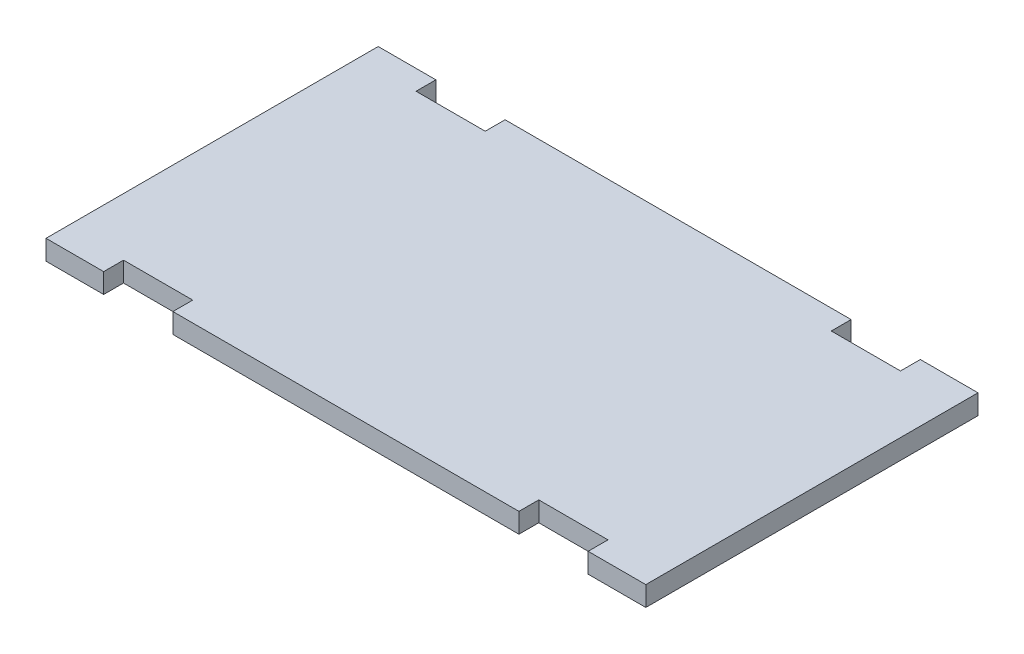
ISO-10303-21;
HEADER;
FILE_DESCRIPTION(('STEP AP214'),'2;1');
FILE_NAME('part.step','',(''),(''),'','','');
FILE_SCHEMA(('AUTOMOTIVE_DESIGN { 1 0 10303 214 1 1 1 1 }'));
ENDSEC;
DATA;
#1=APPLICATION_CONTEXT('core data for automotive mechanical design processes');
#2=APPLICATION_PROTOCOL_DEFINITION('international standard','automotive_design',2000,#1);
#3=PRODUCT_CONTEXT('',#1,'mechanical');
#4=PRODUCT('Part','Part','',(#3));
#5=PRODUCT_RELATED_PRODUCT_CATEGORY('part','',(#4));
#6=PRODUCT_DEFINITION_FORMATION('','',#4);
#7=PRODUCT_DEFINITION_CONTEXT('part definition',#1,'design');
#8=PRODUCT_DEFINITION('design','',#6,#7);
#9=PRODUCT_DEFINITION_SHAPE('','',#8);
#10=(LENGTH_UNIT() NAMED_UNIT(*) SI_UNIT(.MILLI.,.METRE.));
#11=(NAMED_UNIT(*) PLANE_ANGLE_UNIT() SI_UNIT($,.RADIAN.));
#12=(NAMED_UNIT(*) SI_UNIT($,.STERADIAN.) SOLID_ANGLE_UNIT());
#13=UNCERTAINTY_MEASURE_WITH_UNIT(LENGTH_MEASURE(1.E-05),#10,'distance_accuracy_value','');
#14=(GEOMETRIC_REPRESENTATION_CONTEXT(3) GLOBAL_UNCERTAINTY_ASSIGNED_CONTEXT((#13)) GLOBAL_UNIT_ASSIGNED_CONTEXT((#10,
#11,#12)) REPRESENTATION_CONTEXT('',''));
#15=CARTESIAN_POINT('',(0.,0.,0.));
#16=DIRECTION('',(0.,0.,1.));
#17=DIRECTION('',(1.,0.,0.));
#18=AXIS2_PLACEMENT_3D('',#15,#16,#17);
#19=CARTESIAN_POINT('',(-82.55,5.461,-45.461));
#20=DIRECTION('',(0.,0.,1.));
#21=DIRECTION('',(1.,0.,0.));
#22=AXIS2_PLACEMENT_3D('',#19,#20,#21);
#23=PLANE('',#22);
#24=DIRECTION('',(-1.,0.,0.));
#25=VECTOR('',#24,1.);
#26=CARTESIAN_POINT('',(-82.55,5.461,-45.461));
#27=LINE('',#26,#25);
#28=CARTESIAN_POINT('',(47.625,5.461,-45.461));
#29=VERTEX_POINT('',#28);
#30=CARTESIAN_POINT('',(-47.625,5.461,-45.461));
#31=VERTEX_POINT('',#30);
#32=EDGE_CURVE('E236',#29,#31,#27,.T.);
#33=ORIENTED_EDGE('',*,*,#32,.F.);
#34=DIRECTION('',(0.,1.,0.));
#35=VECTOR('',#34,1.);
#36=CARTESIAN_POINT('',(47.625,0.,-45.461));
#37=LINE('',#36,#35);
#38=CARTESIAN_POINT('',(47.625,0.,-45.461));
#39=VERTEX_POINT('',#38);
#40=EDGE_CURVE('E269',#39,#29,#37,.T.);
#41=ORIENTED_EDGE('',*,*,#40,.F.);
#42=DIRECTION('',(-1.,0.,0.));
#43=VECTOR('',#42,1.);
#44=CARTESIAN_POINT('',(-82.55,0.,-45.461));
#45=LINE('',#44,#43);
#46=CARTESIAN_POINT('',(-47.625,0.,-45.461));
#47=VERTEX_POINT('',#46);
#48=EDGE_CURVE('E219',#39,#47,#45,.T.);
#49=ORIENTED_EDGE('',*,*,#48,.T.);
#50=DIRECTION('',(0.,1.,0.));
#51=VECTOR('',#50,1.);
#52=CARTESIAN_POINT('',(-47.625,0.,-45.461));
#53=LINE('',#52,#51);
#54=EDGE_CURVE('E243',#47,#31,#53,.T.);
#55=ORIENTED_EDGE('',*,*,#54,.T.);
#56=EDGE_LOOP('',(#33,#41,#49,#55));
#57=FACE_BOUND('',#56,.T.);
#58=ADVANCED_FACE('F33',(#57),#23,.F.);
#59=CARTESIAN_POINT('',(-66.675,5.461,-45.461));
#60=VERTEX_POINT('',#59);
#61=CARTESIAN_POINT('',(-82.55,5.461,-45.461));
#62=VERTEX_POINT('',#61);
#63=EDGE_CURVE('E204',#60,#62,#27,.T.);
#64=ORIENTED_EDGE('',*,*,#63,.F.);
#65=DIRECTION('',(0.,1.,0.));
#66=VECTOR('',#65,1.);
#67=CARTESIAN_POINT('',(-66.675,0.,-45.461));
#68=LINE('',#67,#66);
#69=CARTESIAN_POINT('',(-66.675,0.,-45.461));
#70=VERTEX_POINT('',#69);
#71=EDGE_CURVE('E226',#70,#60,#68,.T.);
#72=ORIENTED_EDGE('',*,*,#71,.F.);
#73=CARTESIAN_POINT('',(-82.55,0.,-45.461));
#74=VERTEX_POINT('',#73);
#75=EDGE_CURVE('E221',#70,#74,#45,.T.);
#76=ORIENTED_EDGE('',*,*,#75,.T.);
#77=DIRECTION('',(0.,-1.,0.));
#78=VECTOR('',#77,1.);
#79=CARTESIAN_POINT('',(-82.55,5.461,-45.461));
#80=LINE('',#79,#78);
#81=EDGE_CURVE('E41',#62,#74,#80,.T.);
#82=ORIENTED_EDGE('',*,*,#81,.F.);
#83=EDGE_LOOP('',(#64,#72,#76,#82));
#84=FACE_BOUND('',#83,.T.);
#85=ADVANCED_FACE('F364',(#84),#23,.F.);
#86=CARTESIAN_POINT('',(-82.55,5.461,45.979));
#87=DIRECTION('',(0.,0.,-1.));
#88=DIRECTION('',(-1.,0.,0.));
#89=AXIS2_PLACEMENT_3D('',#86,#87,#88);
#90=PLANE('',#89);
#91=DIRECTION('',(1.,0.,0.));
#92=VECTOR('',#91,1.);
#93=CARTESIAN_POINT('',(-82.55,0.,45.979));
#94=LINE('',#93,#92);
#95=CARTESIAN_POINT('',(-47.625,0.,45.979));
#96=VERTEX_POINT('',#95);
#97=CARTESIAN_POINT('',(47.625,0.,45.979));
#98=VERTEX_POINT('',#97);
#99=EDGE_CURVE('E200',#96,#98,#94,.T.);
#100=ORIENTED_EDGE('',*,*,#99,.T.);
#101=DIRECTION('',(0.,1.,0.));
#102=VECTOR('',#101,1.);
#103=CARTESIAN_POINT('',(47.625,0.,45.979));
#104=LINE('',#103,#102);
#105=CARTESIAN_POINT('',(47.625,5.461,45.979));
#106=VERTEX_POINT('',#105);
#107=EDGE_CURVE('E287',#98,#106,#104,.T.);
#108=ORIENTED_EDGE('',*,*,#107,.T.);
#109=DIRECTION('',(1.,0.,0.));
#110=VECTOR('',#109,1.);
#111=CARTESIAN_POINT('',(-82.55,5.461,45.979));
#112=LINE('',#111,#110);
#113=CARTESIAN_POINT('',(-47.625,5.461,45.979));
#114=VERTEX_POINT('',#113);
#115=EDGE_CURVE('E230',#114,#106,#112,.T.);
#116=ORIENTED_EDGE('',*,*,#115,.F.);
#117=DIRECTION('',(0.,1.,0.));
#118=VECTOR('',#117,1.);
#119=CARTESIAN_POINT('',(-47.625,0.,45.979));
#120=LINE('',#119,#118);
#121=EDGE_CURVE('E181',#96,#114,#120,.T.);
#122=ORIENTED_EDGE('',*,*,#121,.F.);
#123=EDGE_LOOP('',(#100,#108,#116,#122));
#124=FACE_BOUND('',#123,.T.);
#125=ADVANCED_FACE('F330',(#124),#90,.F.);
#126=CARTESIAN_POINT('',(-82.55,0.,45.979));
#127=VERTEX_POINT('',#126);
#128=CARTESIAN_POINT('',(-66.675,0.,45.979));
#129=VERTEX_POINT('',#128);
#130=EDGE_CURVE('E189',#127,#129,#94,.T.);
#131=ORIENTED_EDGE('',*,*,#130,.T.);
#132=DIRECTION('',(0.,1.,0.));
#133=VECTOR('',#132,1.);
#134=CARTESIAN_POINT('',(-66.675,0.,45.979));
#135=LINE('',#134,#133);
#136=CARTESIAN_POINT('',(-66.675,5.461,45.979));
#137=VERTEX_POINT('',#136);
#138=EDGE_CURVE('E170',#129,#137,#135,.T.);
#139=ORIENTED_EDGE('',*,*,#138,.T.);
#140=CARTESIAN_POINT('',(-82.55,5.461,45.979));
#141=VERTEX_POINT('',#140);
#142=EDGE_CURVE('E227',#141,#137,#112,.T.);
#143=ORIENTED_EDGE('',*,*,#142,.F.);
#144=DIRECTION('',(0.,-1.,0.));
#145=VECTOR('',#144,1.);
#146=CARTESIAN_POINT('',(-82.55,5.461,45.979));
#147=LINE('',#146,#145);
#148=EDGE_CURVE('E198',#141,#127,#147,.T.);
#149=ORIENTED_EDGE('',*,*,#148,.T.);
#150=EDGE_LOOP('',(#131,#139,#143,#149));
#151=FACE_BOUND('',#150,.T.);
#152=ADVANCED_FACE('F196',(#151),#90,.F.);
#153=CARTESIAN_POINT('',(0.,5.461,0.));
#154=DIRECTION('',(0.,1.,0.));
#155=DIRECTION('',(0.,0.,1.));
#156=AXIS2_PLACEMENT_3D('',#153,#154,#155);
#157=PLANE('',#156);
#158=DIRECTION('',(0.,0.,1.));
#159=VECTOR('',#158,1.);
#160=CARTESIAN_POINT('',(47.625,5.461,-45.461));
#161=LINE('',#160,#159);
#162=CARTESIAN_POINT('',(47.625,5.461,-40.));
#163=VERTEX_POINT('',#162);
#164=EDGE_CURVE('E277',#29,#163,#161,.T.);
#165=ORIENTED_EDGE('',*,*,#164,.F.);
#166=ORIENTED_EDGE('',*,*,#32,.T.);
#167=DIRECTION('',(0.,0.,-1.));
#168=VECTOR('',#167,1.);
#169=CARTESIAN_POINT('',(-47.625,5.461,-45.461));
#170=LINE('',#169,#168);
#171=CARTESIAN_POINT('',(-47.625,5.461,-40.));
#172=VERTEX_POINT('',#171);
#173=EDGE_CURVE('E48',#172,#31,#170,.T.);
#174=ORIENTED_EDGE('',*,*,#173,.F.);
#175=DIRECTION('',(1.,0.,0.));
#176=VECTOR('',#175,1.);
#177=CARTESIAN_POINT('',(-66.6750000000001,5.461,-40.));
#178=LINE('',#177,#176);
#179=CARTESIAN_POINT('',(-66.6750000000001,5.461,-40.));
#180=VERTEX_POINT('',#179);
#181=EDGE_CURVE('E248',#180,#172,#178,.T.);
#182=ORIENTED_EDGE('',*,*,#181,.F.);
#183=DIRECTION('',(0.,0.,1.));
#184=VECTOR('',#183,1.);
#185=CARTESIAN_POINT('',(-66.675,5.461,-45.461));
#186=LINE('',#185,#184);
#187=EDGE_CURVE('E251',#60,#180,#186,.T.);
#188=ORIENTED_EDGE('',*,*,#187,.F.);
#189=ORIENTED_EDGE('',*,*,#63,.T.);
#190=DIRECTION('',(0.,0.,1.));
#191=VECTOR('',#190,1.);
#192=CARTESIAN_POINT('',(-82.55,5.461,-45.461));
#193=LINE('',#192,#191);
#194=EDGE_CURVE('E232',#62,#141,#193,.T.);
#195=ORIENTED_EDGE('',*,*,#194,.T.);
#196=ORIENTED_EDGE('',*,*,#142,.T.);
#197=DIRECTION('',(0.,0.,1.));
#198=VECTOR('',#197,1.);
#199=CARTESIAN_POINT('',(-66.675,5.461,45.979));
#200=LINE('',#199,#198);
#201=CARTESIAN_POINT('',(-66.675,5.461,40.518));
#202=VERTEX_POINT('',#201);
#203=EDGE_CURVE('E176',#202,#137,#200,.T.);
#204=ORIENTED_EDGE('',*,*,#203,.F.);
#205=DIRECTION('',(-1.,0.,0.));
#206=VECTOR('',#205,1.);
#207=CARTESIAN_POINT('',(-66.675,5.461,40.518));
#208=LINE('',#207,#206);
#209=CARTESIAN_POINT('',(-47.625,5.461,40.518));
#210=VERTEX_POINT('',#209);
#211=EDGE_CURVE('E193',#210,#202,#208,.T.);
#212=ORIENTED_EDGE('',*,*,#211,.F.);
#213=DIRECTION('',(0.,0.,-1.));
#214=VECTOR('',#213,1.);
#215=CARTESIAN_POINT('',(-47.625,5.461,45.979));
#216=LINE('',#215,#214);
#217=EDGE_CURVE('E318',#114,#210,#216,.T.);
#218=ORIENTED_EDGE('',*,*,#217,.F.);
#219=ORIENTED_EDGE('',*,*,#115,.T.);
#220=DIRECTION('',(0.,0.,1.));
#221=VECTOR('',#220,1.);
#222=CARTESIAN_POINT('',(47.625,5.461,45.979));
#223=LINE('',#222,#221);
#224=CARTESIAN_POINT('',(47.625,5.461,40.518));
#225=VERTEX_POINT('',#224);
#226=EDGE_CURVE('E271',#225,#106,#223,.T.);
#227=ORIENTED_EDGE('',*,*,#226,.F.);
#228=DIRECTION('',(-1.,0.,0.));
#229=VECTOR('',#228,1.);
#230=CARTESIAN_POINT('',(47.625,5.461,40.518));
#231=LINE('',#230,#229);
#232=CARTESIAN_POINT('',(66.675,5.461,40.518));
#233=VERTEX_POINT('',#232);
#234=EDGE_CURVE('E297',#233,#225,#231,.T.);
#235=ORIENTED_EDGE('',*,*,#234,.F.);
#236=DIRECTION('',(0.,0.,-1.));
#237=VECTOR('',#236,1.);
#238=CARTESIAN_POINT('',(66.675,5.461,45.979));
#239=LINE('',#238,#237);
#240=CARTESIAN_POINT('',(66.675,5.461,45.979));
#241=VERTEX_POINT('',#240);
#242=EDGE_CURVE('E301',#241,#233,#239,.T.);
#243=ORIENTED_EDGE('',*,*,#242,.F.);
#244=CARTESIAN_POINT('',(82.55,5.461,45.979));
#245=VERTEX_POINT('',#244);
#246=EDGE_CURVE('E231',#241,#245,#112,.T.);
#247=ORIENTED_EDGE('',*,*,#246,.T.);
#248=DIRECTION('',(0.,0.,-1.));
#249=VECTOR('',#248,1.);
#250=CARTESIAN_POINT('',(82.55,5.461,-45.461));
#251=LINE('',#250,#249);
#252=CARTESIAN_POINT('',(82.55,5.461,-45.461));
#253=VERTEX_POINT('',#252);
#254=EDGE_CURVE('E199',#245,#253,#251,.T.);
#255=ORIENTED_EDGE('',*,*,#254,.T.);
#256=CARTESIAN_POINT('',(66.675,5.461,-45.461));
#257=VERTEX_POINT('',#256);
#258=EDGE_CURVE('E234',#253,#257,#27,.T.);
#259=ORIENTED_EDGE('',*,*,#258,.T.);
#260=DIRECTION('',(0.,0.,-1.));
#261=VECTOR('',#260,1.);
#262=CARTESIAN_POINT('',(66.675,5.461,-45.461));
#263=LINE('',#262,#261);
#264=CARTESIAN_POINT('',(66.675,5.461,-40.));
#265=VERTEX_POINT('',#264);
#266=EDGE_CURVE('E56',#265,#257,#263,.T.);
#267=ORIENTED_EDGE('',*,*,#266,.F.);
#268=DIRECTION('',(1.,0.,0.));
#269=VECTOR('',#268,1.);
#270=CARTESIAN_POINT('',(47.625,5.461,-40.));
#271=LINE('',#270,#269);
#272=EDGE_CURVE('E274',#163,#265,#271,.T.);
#273=ORIENTED_EDGE('',*,*,#272,.F.);
#274=EDGE_LOOP('',(#165,#166,#174,#182,#188,#189,#195,#196,#204,#212,#218,#219,#227,#235,#243,
#247,#255,#259,#267,#273));
#275=FACE_BOUND('',#274,.T.);
#276=ADVANCED_FACE('F337',(#275),#157,.T.);
#277=CARTESIAN_POINT('',(0.,0.,0.));
#278=DIRECTION('',(0.,1.,0.));
#279=DIRECTION('',(0.,0.,1.));
#280=AXIS2_PLACEMENT_3D('',#277,#278,#279);
#281=PLANE('',#280);
#282=ORIENTED_EDGE('',*,*,#48,.F.);
#283=DIRECTION('',(0.,0.,1.));
#284=VECTOR('',#283,1.);
#285=CARTESIAN_POINT('',(47.625,0.,-45.461));
#286=LINE('',#285,#284);
#287=CARTESIAN_POINT('',(47.625,0.,-40.));
#288=VERTEX_POINT('',#287);
#289=EDGE_CURVE('E273',#39,#288,#286,.T.);
#290=ORIENTED_EDGE('',*,*,#289,.T.);
#291=DIRECTION('',(1.,0.,0.));
#292=VECTOR('',#291,1.);
#293=CARTESIAN_POINT('',(47.625,0.,-40.));
#294=LINE('',#293,#292);
#295=CARTESIAN_POINT('',(66.675,0.,-40.));
#296=VERTEX_POINT('',#295);
#297=EDGE_CURVE('E282',#288,#296,#294,.T.);
#298=ORIENTED_EDGE('',*,*,#297,.T.);
#299=DIRECTION('',(0.,0.,-1.));
#300=VECTOR('',#299,1.);
#301=CARTESIAN_POINT('',(66.675,0.,-45.461));
#302=LINE('',#301,#300);
#303=CARTESIAN_POINT('',(66.675,0.,-45.461));
#304=VERTEX_POINT('',#303);
#305=EDGE_CURVE('E265',#296,#304,#302,.T.);
#306=ORIENTED_EDGE('',*,*,#305,.T.);
#307=CARTESIAN_POINT('',(82.55,0.,-45.461));
#308=VERTEX_POINT('',#307);
#309=EDGE_CURVE('E215',#308,#304,#45,.T.);
#310=ORIENTED_EDGE('',*,*,#309,.F.);
#311=DIRECTION('',(0.,0.,-1.));
#312=VECTOR('',#311,1.);
#313=CARTESIAN_POINT('',(82.55,0.,-45.461));
#314=LINE('',#313,#312);
#315=CARTESIAN_POINT('',(82.55,0.,45.979));
#316=VERTEX_POINT('',#315);
#317=EDGE_CURVE('E223',#316,#308,#314,.T.);
#318=ORIENTED_EDGE('',*,*,#317,.F.);
#319=CARTESIAN_POINT('',(66.675,0.,45.979));
#320=VERTEX_POINT('',#319);
#321=EDGE_CURVE('E202',#320,#316,#94,.T.);
#322=ORIENTED_EDGE('',*,*,#321,.F.);
#323=DIRECTION('',(0.,0.,-1.));
#324=VECTOR('',#323,1.);
#325=CARTESIAN_POINT('',(66.675,0.,45.979));
#326=LINE('',#325,#324);
#327=CARTESIAN_POINT('',(66.675,0.,40.518));
#328=VERTEX_POINT('',#327);
#329=EDGE_CURVE('E307',#320,#328,#326,.T.);
#330=ORIENTED_EDGE('',*,*,#329,.T.);
#331=DIRECTION('',(-1.,0.,0.));
#332=VECTOR('',#331,1.);
#333=CARTESIAN_POINT('',(47.625,0.,40.518));
#334=LINE('',#333,#332);
#335=CARTESIAN_POINT('',(47.625,0.,40.518));
#336=VERTEX_POINT('',#335);
#337=EDGE_CURVE('E291',#328,#336,#334,.T.);
#338=ORIENTED_EDGE('',*,*,#337,.T.);
#339=DIRECTION('',(0.,0.,1.));
#340=VECTOR('',#339,1.);
#341=CARTESIAN_POINT('',(47.625,0.,45.979));
#342=LINE('',#341,#340);
#343=EDGE_CURVE('E300',#336,#98,#342,.T.);
#344=ORIENTED_EDGE('',*,*,#343,.T.);
#345=ORIENTED_EDGE('',*,*,#99,.F.);
#346=DIRECTION('',(0.,0.,-1.));
#347=VECTOR('',#346,1.);
#348=CARTESIAN_POINT('',(-47.625,0.,45.979));
#349=LINE('',#348,#347);
#350=CARTESIAN_POINT('',(-47.625,0.,40.518));
#351=VERTEX_POINT('',#350);
#352=EDGE_CURVE('E192',#96,#351,#349,.T.);
#353=ORIENTED_EDGE('',*,*,#352,.T.);
#354=DIRECTION('',(-1.,0.,0.));
#355=VECTOR('',#354,1.);
#356=CARTESIAN_POINT('',(-66.675,0.,40.518));
#357=LINE('',#356,#355);
#358=CARTESIAN_POINT('',(-66.675,0.,40.518));
#359=VERTEX_POINT('',#358);
#360=EDGE_CURVE('E182',#351,#359,#357,.T.);
#361=ORIENTED_EDGE('',*,*,#360,.T.);
#362=DIRECTION('',(0.,0.,1.));
#363=VECTOR('',#362,1.);
#364=CARTESIAN_POINT('',(-66.675,0.,45.979));
#365=LINE('',#364,#363);
#366=EDGE_CURVE('E173',#359,#129,#365,.T.);
#367=ORIENTED_EDGE('',*,*,#366,.T.);
#368=ORIENTED_EDGE('',*,*,#130,.F.);
#369=DIRECTION('',(0.,0.,1.));
#370=VECTOR('',#369,1.);
#371=CARTESIAN_POINT('',(-82.55,0.,-45.461));
#372=LINE('',#371,#370);
#373=EDGE_CURVE('E209',#74,#127,#372,.T.);
#374=ORIENTED_EDGE('',*,*,#373,.F.);
#375=ORIENTED_EDGE('',*,*,#75,.F.);
#376=DIRECTION('',(0.,0.,1.));
#377=VECTOR('',#376,1.);
#378=CARTESIAN_POINT('',(-66.675,0.,-45.461));
#379=LINE('',#378,#377);
#380=CARTESIAN_POINT('',(-66.6750000000001,0.,-40.));
#381=VERTEX_POINT('',#380);
#382=EDGE_CURVE('E247',#70,#381,#379,.T.);
#383=ORIENTED_EDGE('',*,*,#382,.T.);
#384=DIRECTION('',(1.,0.,0.));
#385=VECTOR('',#384,1.);
#386=CARTESIAN_POINT('',(-66.6750000000001,0.,-40.));
#387=LINE('',#386,#385);
#388=CARTESIAN_POINT('',(-47.625,0.,-40.));
#389=VERTEX_POINT('',#388);
#390=EDGE_CURVE('E257',#381,#389,#387,.T.);
#391=ORIENTED_EDGE('',*,*,#390,.T.);
#392=DIRECTION('',(0.,0.,-1.));
#393=VECTOR('',#392,1.);
#394=CARTESIAN_POINT('',(-47.625,0.,-45.461));
#395=LINE('',#394,#393);
#396=EDGE_CURVE('E241',#389,#47,#395,.T.);
#397=ORIENTED_EDGE('',*,*,#396,.T.);
#398=EDGE_LOOP('',(#282,#290,#298,#306,#310,#318,#322,#330,#338,#344,#345,#353,#361,#367,#368,
#374,#375,#383,#391,#397));
#399=FACE_BOUND('',#398,.T.);
#400=ADVANCED_FACE('F187',(#399),#281,.F.);
#401=CARTESIAN_POINT('',(82.55,5.461,-45.461));
#402=DIRECTION('',(-1.,0.,0.));
#403=DIRECTION('',(0.,0.,1.));
#404=AXIS2_PLACEMENT_3D('',#401,#402,#403);
#405=PLANE('',#404);
#406=ORIENTED_EDGE('',*,*,#317,.T.);
#407=DIRECTION('',(0.,-1.,0.));
#408=VECTOR('',#407,1.);
#409=CARTESIAN_POINT('',(82.55,5.461,-45.461));
#410=LINE('',#409,#408);
#411=EDGE_CURVE('E11',#253,#308,#410,.T.);
#412=ORIENTED_EDGE('',*,*,#411,.F.);
#413=ORIENTED_EDGE('',*,*,#254,.F.);
#414=DIRECTION('',(0.,-1.,0.));
#415=VECTOR('',#414,1.);
#416=CARTESIAN_POINT('',(82.55,5.461,45.979));
#417=LINE('',#416,#415);
#418=EDGE_CURVE('E229',#245,#316,#417,.T.);
#419=ORIENTED_EDGE('',*,*,#418,.T.);
#420=EDGE_LOOP('',(#406,#412,#413,#419));
#421=FACE_BOUND('',#420,.T.);
#422=ADVANCED_FACE('F35',(#421),#405,.F.);
#423=ORIENTED_EDGE('',*,*,#309,.T.);
#424=DIRECTION('',(0.,1.,0.));
#425=VECTOR('',#424,1.);
#426=CARTESIAN_POINT('',(66.675,0.,-45.461));
#427=LINE('',#426,#425);
#428=EDGE_CURVE('E267',#304,#257,#427,.T.);
#429=ORIENTED_EDGE('',*,*,#428,.T.);
#430=ORIENTED_EDGE('',*,*,#258,.F.);
#431=ORIENTED_EDGE('',*,*,#411,.T.);
#432=EDGE_LOOP('',(#423,#429,#430,#431));
#433=FACE_BOUND('',#432,.T.);
#434=ADVANCED_FACE('F345',(#433),#23,.F.);
#435=CARTESIAN_POINT('',(-82.55,5.461,-45.461));
#436=DIRECTION('',(1.,0.,0.));
#437=DIRECTION('',(0.,0.,-1.));
#438=AXIS2_PLACEMENT_3D('',#435,#436,#437);
#439=PLANE('',#438);
#440=ORIENTED_EDGE('',*,*,#373,.T.);
#441=ORIENTED_EDGE('',*,*,#148,.F.);
#442=ORIENTED_EDGE('',*,*,#194,.F.);
#443=ORIENTED_EDGE('',*,*,#81,.T.);
#444=EDGE_LOOP('',(#440,#441,#442,#443));
#445=FACE_BOUND('',#444,.T.);
#446=ADVANCED_FACE('F366',(#445),#439,.F.);
#447=ORIENTED_EDGE('',*,*,#246,.F.);
#448=DIRECTION('',(0.,1.,0.));
#449=VECTOR('',#448,1.);
#450=CARTESIAN_POINT('',(66.675,0.,45.979));
#451=LINE('',#450,#449);
#452=EDGE_CURVE('E290',#320,#241,#451,.T.);
#453=ORIENTED_EDGE('',*,*,#452,.F.);
#454=ORIENTED_EDGE('',*,*,#321,.T.);
#455=ORIENTED_EDGE('',*,*,#418,.F.);
#456=EDGE_LOOP('',(#447,#453,#454,#455));
#457=FACE_BOUND('',#456,.T.);
#458=ADVANCED_FACE('F341',(#457),#90,.F.);
#459=CARTESIAN_POINT('',(-66.675,0.,45.979));
#460=DIRECTION('',(-1.,0.,0.));
#461=DIRECTION('',(0.,0.,1.));
#462=AXIS2_PLACEMENT_3D('',#459,#460,#461);
#463=PLANE('',#462);
#464=ORIENTED_EDGE('',*,*,#203,.T.);
#465=ORIENTED_EDGE('',*,*,#138,.F.);
#466=ORIENTED_EDGE('',*,*,#366,.F.);
#467=DIRECTION('',(0.,1.,0.));
#468=VECTOR('',#467,1.);
#469=CARTESIAN_POINT('',(-66.675,0.,40.518));
#470=LINE('',#469,#468);
#471=EDGE_CURVE('E254',#359,#202,#470,.T.);
#472=ORIENTED_EDGE('',*,*,#471,.T.);
#473=EDGE_LOOP('',(#464,#465,#466,#472));
#474=FACE_BOUND('',#473,.T.);
#475=ADVANCED_FACE('F172',(#474),#463,.F.);
#476=CARTESIAN_POINT('',(-66.675,0.,40.518));
#477=DIRECTION('',(0.,0.,-1.));
#478=DIRECTION('',(-1.,0.,0.));
#479=AXIS2_PLACEMENT_3D('',#476,#477,#478);
#480=PLANE('',#479);
#481=ORIENTED_EDGE('',*,*,#211,.T.);
#482=ORIENTED_EDGE('',*,*,#471,.F.);
#483=ORIENTED_EDGE('',*,*,#360,.F.);
#484=DIRECTION('',(0.,1.,0.));
#485=VECTOR('',#484,1.);
#486=CARTESIAN_POINT('',(-47.625,0.,40.518));
#487=LINE('',#486,#485);
#488=EDGE_CURVE('E313',#351,#210,#487,.T.);
#489=ORIENTED_EDGE('',*,*,#488,.T.);
#490=EDGE_LOOP('',(#481,#482,#483,#489));
#491=FACE_BOUND('',#490,.T.);
#492=ADVANCED_FACE('F411',(#491),#480,.F.);
#493=CARTESIAN_POINT('',(-47.625,0.,45.979));
#494=DIRECTION('',(1.,0.,0.));
#495=DIRECTION('',(0.,0.,-1.));
#496=AXIS2_PLACEMENT_3D('',#493,#494,#495);
#497=PLANE('',#496);
#498=ORIENTED_EDGE('',*,*,#217,.T.);
#499=ORIENTED_EDGE('',*,*,#488,.F.);
#500=ORIENTED_EDGE('',*,*,#352,.F.);
#501=ORIENTED_EDGE('',*,*,#121,.T.);
#502=EDGE_LOOP('',(#498,#499,#500,#501));
#503=FACE_BOUND('',#502,.T.);
#504=ADVANCED_FACE('F326',(#503),#497,.F.);
#505=CARTESIAN_POINT('',(47.625,0.,45.979));
#506=DIRECTION('',(-1.,0.,0.));
#507=DIRECTION('',(0.,0.,1.));
#508=AXIS2_PLACEMENT_3D('',#505,#506,#507);
#509=PLANE('',#508);
#510=ORIENTED_EDGE('',*,*,#226,.T.);
#511=ORIENTED_EDGE('',*,*,#107,.F.);
#512=ORIENTED_EDGE('',*,*,#343,.F.);
#513=DIRECTION('',(0.,1.,0.));
#514=VECTOR('',#513,1.);
#515=CARTESIAN_POINT('',(47.625,0.,40.518));
#516=LINE('',#515,#514);
#517=EDGE_CURVE('E295',#336,#225,#516,.T.);
#518=ORIENTED_EDGE('',*,*,#517,.T.);
#519=EDGE_LOOP('',(#510,#511,#512,#518));
#520=FACE_BOUND('',#519,.T.);
#521=ADVANCED_FACE('F493',(#520),#509,.F.);
#522=CARTESIAN_POINT('',(47.625,0.,40.518));
#523=DIRECTION('',(0.,0.,-1.));
#524=DIRECTION('',(-1.,0.,0.));
#525=AXIS2_PLACEMENT_3D('',#522,#523,#524);
#526=PLANE('',#525);
#527=ORIENTED_EDGE('',*,*,#234,.T.);
#528=ORIENTED_EDGE('',*,*,#517,.F.);
#529=ORIENTED_EDGE('',*,*,#337,.F.);
#530=DIRECTION('',(0.,1.,0.));
#531=VECTOR('',#530,1.);
#532=CARTESIAN_POINT('',(66.675,0.,40.518));
#533=LINE('',#532,#531);
#534=EDGE_CURVE('E293',#328,#233,#533,.T.);
#535=ORIENTED_EDGE('',*,*,#534,.T.);
#536=EDGE_LOOP('',(#527,#528,#529,#535));
#537=FACE_BOUND('',#536,.T.);
#538=ADVANCED_FACE('F384',(#537),#526,.F.);
#539=CARTESIAN_POINT('',(66.675,0.,45.979));
#540=DIRECTION('',(1.,0.,0.));
#541=DIRECTION('',(0.,0.,-1.));
#542=AXIS2_PLACEMENT_3D('',#539,#540,#541);
#543=PLANE('',#542);
#544=ORIENTED_EDGE('',*,*,#242,.T.);
#545=ORIENTED_EDGE('',*,*,#534,.F.);
#546=ORIENTED_EDGE('',*,*,#329,.F.);
#547=ORIENTED_EDGE('',*,*,#452,.T.);
#548=EDGE_LOOP('',(#544,#545,#546,#547));
#549=FACE_BOUND('',#548,.T.);
#550=ADVANCED_FACE('F377',(#549),#543,.F.);
#551=CARTESIAN_POINT('',(-66.675,0.,-45.461));
#552=DIRECTION('',(-1.,0.,0.));
#553=DIRECTION('',(0.,0.,1.));
#554=AXIS2_PLACEMENT_3D('',#551,#552,#553);
#555=PLANE('',#554);
#556=ORIENTED_EDGE('',*,*,#187,.T.);
#557=DIRECTION('',(0.,1.,0.));
#558=VECTOR('',#557,1.);
#559=CARTESIAN_POINT('',(-66.6750000000001,0.,-40.));
#560=LINE('',#559,#558);
#561=EDGE_CURVE('E238',#381,#180,#560,.T.);
#562=ORIENTED_EDGE('',*,*,#561,.F.);
#563=ORIENTED_EDGE('',*,*,#382,.F.);
#564=ORIENTED_EDGE('',*,*,#71,.T.);
#565=EDGE_LOOP('',(#556,#562,#563,#564));
#566=FACE_BOUND('',#565,.T.);
#567=ADVANCED_FACE('F374',(#566),#555,.F.);
#568=CARTESIAN_POINT('',(-47.625,0.,-45.461));
#569=DIRECTION('',(1.,0.,0.));
#570=DIRECTION('',(0.,0.,-1.));
#571=AXIS2_PLACEMENT_3D('',#568,#569,#570);
#572=PLANE('',#571);
#573=ORIENTED_EDGE('',*,*,#173,.T.);
#574=ORIENTED_EDGE('',*,*,#54,.F.);
#575=ORIENTED_EDGE('',*,*,#396,.F.);
#576=DIRECTION('',(0.,1.,0.));
#577=VECTOR('',#576,1.);
#578=CARTESIAN_POINT('',(-47.625,0.,-40.));
#579=LINE('',#578,#577);
#580=EDGE_CURVE('E240',#389,#172,#579,.T.);
#581=ORIENTED_EDGE('',*,*,#580,.T.);
#582=EDGE_LOOP('',(#573,#574,#575,#581));
#583=FACE_BOUND('',#582,.T.);
#584=ADVANCED_FACE('F376',(#583),#572,.F.);
#585=CARTESIAN_POINT('',(-66.6750000000001,0.,-40.));
#586=DIRECTION('',(0.,0.,1.));
#587=DIRECTION('',(1.,0.,0.));
#588=AXIS2_PLACEMENT_3D('',#585,#586,#587);
#589=PLANE('',#588);
#590=ORIENTED_EDGE('',*,*,#181,.T.);
#591=ORIENTED_EDGE('',*,*,#580,.F.);
#592=ORIENTED_EDGE('',*,*,#390,.F.);
#593=ORIENTED_EDGE('',*,*,#561,.T.);
#594=EDGE_LOOP('',(#590,#591,#592,#593));
#595=FACE_BOUND('',#594,.T.);
#596=ADVANCED_FACE('F371',(#595),#589,.F.);
#597=CARTESIAN_POINT('',(47.625,0.,-45.461));
#598=DIRECTION('',(-1.,0.,0.));
#599=DIRECTION('',(0.,0.,1.));
#600=AXIS2_PLACEMENT_3D('',#597,#598,#599);
#601=PLANE('',#600);
#602=ORIENTED_EDGE('',*,*,#164,.T.);
#603=DIRECTION('',(0.,1.,0.));
#604=VECTOR('',#603,1.);
#605=CARTESIAN_POINT('',(47.625,0.,-40.));
#606=LINE('',#605,#604);
#607=EDGE_CURVE('E262',#288,#163,#606,.T.);
#608=ORIENTED_EDGE('',*,*,#607,.F.);
#609=ORIENTED_EDGE('',*,*,#289,.F.);
#610=ORIENTED_EDGE('',*,*,#40,.T.);
#611=EDGE_LOOP('',(#602,#608,#609,#610));
#612=FACE_BOUND('',#611,.T.);
#613=ADVANCED_FACE('F354',(#612),#601,.F.);
#614=CARTESIAN_POINT('',(66.675,0.,-45.461));
#615=DIRECTION('',(1.,0.,0.));
#616=DIRECTION('',(0.,0.,-1.));
#617=AXIS2_PLACEMENT_3D('',#614,#615,#616);
#618=PLANE('',#617);
#619=ORIENTED_EDGE('',*,*,#266,.T.);
#620=ORIENTED_EDGE('',*,*,#428,.F.);
#621=ORIENTED_EDGE('',*,*,#305,.F.);
#622=DIRECTION('',(0.,1.,0.));
#623=VECTOR('',#622,1.);
#624=CARTESIAN_POINT('',(66.675,0.,-40.));
#625=LINE('',#624,#623);
#626=EDGE_CURVE('E264',#296,#265,#625,.T.);
#627=ORIENTED_EDGE('',*,*,#626,.T.);
#628=EDGE_LOOP('',(#619,#620,#621,#627));
#629=FACE_BOUND('',#628,.T.);
#630=ADVANCED_FACE('F537',(#629),#618,.F.);
#631=CARTESIAN_POINT('',(47.625,0.,-40.));
#632=DIRECTION('',(0.,0.,1.));
#633=DIRECTION('',(1.,0.,0.));
#634=AXIS2_PLACEMENT_3D('',#631,#632,#633);
#635=PLANE('',#634);
#636=ORIENTED_EDGE('',*,*,#272,.T.);
#637=ORIENTED_EDGE('',*,*,#626,.F.);
#638=ORIENTED_EDGE('',*,*,#297,.F.);
#639=ORIENTED_EDGE('',*,*,#607,.T.);
#640=EDGE_LOOP('',(#636,#637,#638,#639));
#641=FACE_BOUND('',#640,.T.);
#642=ADVANCED_FACE('F350',(#641),#635,.F.);
#643=CLOSED_SHELL('',(#58,#85,#125,#152,#276,#400,#422,#434,#446,#458,#475,#492,#504,#521,#538,
#550,#567,#584,#596,#613,#630,#642));
#644=MANIFOLD_SOLID_BREP('B2',#643);
#645=ADVANCED_BREP_SHAPE_REPRESENTATION('',(#18,#644),#14);
#646=SHAPE_DEFINITION_REPRESENTATION(#9,#645);
ENDSEC;
END-ISO-10303-21;
